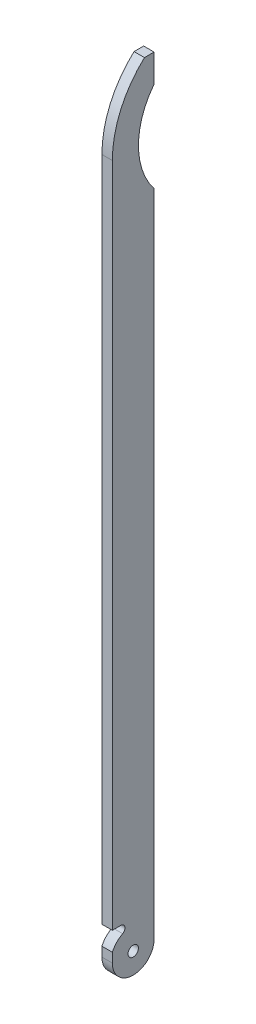
ISO-10303-21;
HEADER;
FILE_DESCRIPTION(('STEP AP214'),'2;1');
FILE_NAME('part.step','',(''),(''),'','','');
FILE_SCHEMA(('AUTOMOTIVE_DESIGN { 1 0 10303 214 1 1 1 1 }'));
ENDSEC;
DATA;
#1=APPLICATION_CONTEXT('core data for automotive mechanical design processes');
#2=APPLICATION_PROTOCOL_DEFINITION('international standard','automotive_design',2000,#1);
#3=PRODUCT_CONTEXT('',#1,'mechanical');
#4=PRODUCT('Part','Part','',(#3));
#5=PRODUCT_RELATED_PRODUCT_CATEGORY('part','',(#4));
#6=PRODUCT_DEFINITION_FORMATION('','',#4);
#7=PRODUCT_DEFINITION_CONTEXT('part definition',#1,'design');
#8=PRODUCT_DEFINITION('design','',#6,#7);
#9=PRODUCT_DEFINITION_SHAPE('','',#8);
#10=(LENGTH_UNIT() NAMED_UNIT(*) SI_UNIT(.MILLI.,.METRE.));
#11=(NAMED_UNIT(*) PLANE_ANGLE_UNIT() SI_UNIT($,.RADIAN.));
#12=(NAMED_UNIT(*) SI_UNIT($,.STERADIAN.) SOLID_ANGLE_UNIT());
#13=UNCERTAINTY_MEASURE_WITH_UNIT(LENGTH_MEASURE(1.E-05),#10,'distance_accuracy_value','');
#14=(GEOMETRIC_REPRESENTATION_CONTEXT(3) GLOBAL_UNCERTAINTY_ASSIGNED_CONTEXT((#13)) GLOBAL_UNIT_ASSIGNED_CONTEXT((#10,
#11,#12)) REPRESENTATION_CONTEXT('',''));
#15=CARTESIAN_POINT('',(0.,0.,0.));
#16=DIRECTION('',(0.,0.,1.));
#17=DIRECTION('',(1.,0.,0.));
#18=AXIS2_PLACEMENT_3D('',#15,#16,#17);
#19=CARTESIAN_POINT('',(0.,378.,20.));
#20=DIRECTION('',(0.,0.,-1.));
#21=DIRECTION('',(-1.,0.,0.));
#22=AXIS2_PLACEMENT_3D('',#19,#20,#21);
#23=PLANE('',#22);
#24=DIRECTION('',(0.,-1.,0.));
#25=VECTOR('',#24,1.);
#26=CARTESIAN_POINT('',(5.,378.,20.));
#27=LINE('',#26,#25);
#28=CARTESIAN_POINT('',(5.,14.520650354293,20.));
#29=VERTEX_POINT('',#28);
#30=CARTESIAN_POINT('',(5.00000000000001,10.,20.));
#31=VERTEX_POINT('',#30);
#32=EDGE_CURVE('E197',#29,#31,#27,.T.);
#33=ORIENTED_EDGE('',*,*,#32,.F.);
#34=DIRECTION('',(1.,0.,0.));
#35=VECTOR('',#34,1.);
#36=CARTESIAN_POINT('',(0.,14.520650354293,20.));
#37=LINE('',#36,#35);
#38=CARTESIAN_POINT('',(0.,14.520650354293,20.));
#39=VERTEX_POINT('',#38);
#40=EDGE_CURVE('E148',#39,#29,#37,.T.);
#41=ORIENTED_EDGE('',*,*,#40,.F.);
#42=DIRECTION('',(0.,-1.,0.));
#43=VECTOR('',#42,1.);
#44=CARTESIAN_POINT('',(0.,378.,20.));
#45=LINE('',#44,#43);
#46=CARTESIAN_POINT('',(0.,10.,20.));
#47=VERTEX_POINT('',#46);
#48=EDGE_CURVE('E201',#39,#47,#45,.T.);
#49=ORIENTED_EDGE('',*,*,#48,.T.);
#50=DIRECTION('',(-1.,0.,0.));
#51=VECTOR('',#50,1.);
#52=CARTESIAN_POINT('',(5.00000000000001,10.,20.));
#53=LINE('',#52,#51);
#54=EDGE_CURVE('E177',#31,#47,#53,.T.);
#55=ORIENTED_EDGE('',*,*,#54,.F.);
#56=EDGE_LOOP('',(#33,#41,#49,#55));
#57=FACE_BOUND('',#56,.T.);
#58=ADVANCED_FACE('F36',(#57),#23,.F.);
#59=CARTESIAN_POINT('',(0.,343.,20.));
#60=VERTEX_POINT('',#59);
#61=CARTESIAN_POINT('',(0.,23.61,20.));
#62=VERTEX_POINT('',#61);
#63=EDGE_CURVE('E202',#60,#62,#45,.T.);
#64=ORIENTED_EDGE('',*,*,#63,.T.);
#65=DIRECTION('',(1.,0.,0.));
#66=VECTOR('',#65,1.);
#67=CARTESIAN_POINT('',(0.,23.61,20.));
#68=LINE('',#67,#66);
#69=CARTESIAN_POINT('',(5.,23.61,20.));
#70=VERTEX_POINT('',#69);
#71=EDGE_CURVE('E124',#62,#70,#68,.T.);
#72=ORIENTED_EDGE('',*,*,#71,.T.);
#73=CARTESIAN_POINT('',(5.00000000000001,343.,20.));
#74=VERTEX_POINT('',#73);
#75=EDGE_CURVE('E198',#74,#70,#27,.T.);
#76=ORIENTED_EDGE('',*,*,#75,.F.);
#77=DIRECTION('',(-1.,0.,0.));
#78=VECTOR('',#77,1.);
#79=CARTESIAN_POINT('',(5.00000000000001,343.,20.));
#80=LINE('',#79,#78);
#81=EDGE_CURVE('E152',#74,#60,#80,.T.);
#82=ORIENTED_EDGE('',*,*,#81,.T.);
#83=EDGE_LOOP('',(#64,#72,#76,#82));
#84=FACE_BOUND('',#83,.T.);
#85=ADVANCED_FACE('F219',(#84),#23,.F.);
#86=CARTESIAN_POINT('',(0.,378.,0.));
#87=DIRECTION('',(0.,0.,1.));
#88=DIRECTION('',(1.,0.,0.));
#89=AXIS2_PLACEMENT_3D('',#86,#87,#88);
#90=PLANE('',#89);
#91=DIRECTION('',(0.,-1.,0.));
#92=VECTOR('',#91,1.);
#93=CARTESIAN_POINT('',(5.,378.,0.));
#94=LINE('',#93,#92);
#95=CARTESIAN_POINT('',(5.,378.,0.));
#96=VERTEX_POINT('',#95);
#97=CARTESIAN_POINT('',(5.,364.650635094611,0.));
#98=VERTEX_POINT('',#97);
#99=EDGE_CURVE('E194',#96,#98,#94,.T.);
#100=ORIENTED_EDGE('',*,*,#99,.T.);
#101=DIRECTION('',(-1.,0.,0.));
#102=VECTOR('',#101,1.);
#103=CARTESIAN_POINT('',(5.,364.650635094611,0.));
#104=LINE('',#103,#102);
#105=CARTESIAN_POINT('',(0.,364.650635094611,0.));
#106=VERTEX_POINT('',#105);
#107=EDGE_CURVE('E161',#98,#106,#104,.T.);
#108=ORIENTED_EDGE('',*,*,#107,.T.);
#109=DIRECTION('',(0.,-1.,0.));
#110=VECTOR('',#109,1.);
#111=CARTESIAN_POINT('',(0.,378.,0.));
#112=LINE('',#111,#110);
#113=CARTESIAN_POINT('',(0.,378.,0.));
#114=VERTEX_POINT('',#113);
#115=EDGE_CURVE('E190',#114,#106,#112,.T.);
#116=ORIENTED_EDGE('',*,*,#115,.F.);
#117=DIRECTION('',(-1.,0.,0.));
#118=VECTOR('',#117,1.);
#119=CARTESIAN_POINT('',(0.,378.,0.));
#120=LINE('',#119,#118);
#121=EDGE_CURVE('E187',#96,#114,#120,.T.);
#122=ORIENTED_EDGE('',*,*,#121,.F.);
#123=EDGE_LOOP('',(#100,#108,#116,#122));
#124=FACE_BOUND('',#123,.T.);
#125=ADVANCED_FACE('F212',(#124),#90,.F.);
#126=CARTESIAN_POINT('',(0.,321.349364905389,0.));
#127=VERTEX_POINT('',#126);
#128=CARTESIAN_POINT('',(0.,10.,0.));
#129=VERTEX_POINT('',#128);
#130=EDGE_CURVE('E189',#127,#129,#112,.T.);
#131=ORIENTED_EDGE('',*,*,#130,.F.);
#132=DIRECTION('',(-1.,0.,0.));
#133=VECTOR('',#132,1.);
#134=CARTESIAN_POINT('',(5.,321.349364905389,0.));
#135=LINE('',#134,#133);
#136=CARTESIAN_POINT('',(5.00000000000001,321.349364905389,0.));
#137=VERTEX_POINT('',#136);
#138=EDGE_CURVE('E158',#127,#137,#135,.F.);
#139=ORIENTED_EDGE('',*,*,#138,.T.);
#140=CARTESIAN_POINT('',(5.,10.,0.));
#141=VERTEX_POINT('',#140);
#142=EDGE_CURVE('E193',#137,#141,#94,.T.);
#143=ORIENTED_EDGE('',*,*,#142,.T.);
#144=DIRECTION('',(-1.,0.,0.));
#145=VECTOR('',#144,1.);
#146=CARTESIAN_POINT('',(5.,10.,0.));
#147=LINE('',#146,#145);
#148=EDGE_CURVE('E174',#141,#129,#147,.T.);
#149=ORIENTED_EDGE('',*,*,#148,.T.);
#150=EDGE_LOOP('',(#131,#139,#143,#149));
#151=FACE_BOUND('',#150,.T.);
#152=ADVANCED_FACE('F243',(#151),#90,.F.);
#153=CARTESIAN_POINT('',(0.,378.,0.));
#154=DIRECTION('',(1.,0.,0.));
#155=DIRECTION('',(0.,0.,-1.));
#156=AXIS2_PLACEMENT_3D('',#153,#154,#155);
#157=PLANE('',#156);
#158=CARTESIAN_POINT('',(0.,10.,10.));
#159=DIRECTION('',(-1.,0.,0.));
#160=DIRECTION('',(0.,0.,1.));
#161=AXIS2_PLACEMENT_3D('',#158,#159,#160);
#162=CIRCLE('',#161,2.5);
#163=CARTESIAN_POINT('',(0.,10.,12.5));
#164=VERTEX_POINT('',#163);
#165=EDGE_CURVE('E164',#164,#164,#162,.T.);
#166=ORIENTED_EDGE('',*,*,#165,.F.);
#167=EDGE_LOOP('',(#166));
#168=FACE_BOUND('',#167,.T.);
#169=ORIENTED_EDGE('',*,*,#48,.F.);
#170=CARTESIAN_POINT('',(0.,10.,10.));
#171=DIRECTION('',(-1.,0.,0.));
#172=DIRECTION('',(0.,0.,-1.));
#173=AXIS2_PLACEMENT_3D('',#170,#171,#172);
#174=CIRCLE('',#173,10.974346432739);
#175=CARTESIAN_POINT('',(0.,19.7404845162571,15.0556148008255));
#176=VERTEX_POINT('',#175);
#177=EDGE_CURVE('E125',#39,#176,#174,.T.);
#178=ORIENTED_EDGE('',*,*,#177,.T.);
#179=CARTESIAN_POINT('',(0.,21.56,16.));
#180=DIRECTION('',(1.,0.,0.));
#181=DIRECTION('',(0.,0.,-1.));
#182=AXIS2_PLACEMENT_3D('',#179,#180,#181);
#183=CIRCLE('',#182,2.05);
#184=CARTESIAN_POINT('',(0.,23.61,16.));
#185=VERTEX_POINT('',#184);
#186=EDGE_CURVE('E120',#176,#185,#183,.T.);
#187=ORIENTED_EDGE('',*,*,#186,.T.);
#188=DIRECTION('',(0.,0.,1.));
#189=VECTOR('',#188,1.);
#190=CARTESIAN_POINT('',(0.,23.61,16.));
#191=LINE('',#190,#189);
#192=EDGE_CURVE('E128',#185,#62,#191,.T.);
#193=ORIENTED_EDGE('',*,*,#192,.T.);
#194=ORIENTED_EDGE('',*,*,#63,.F.);
#195=CARTESIAN_POINT('',(0.,343.,-27.5));
#196=DIRECTION('',(1.,0.,0.));
#197=DIRECTION('',(0.,0.,1.));
#198=AXIS2_PLACEMENT_3D('',#195,#196,#197);
#199=CIRCLE('',#198,47.5);
#200=CARTESIAN_POINT('',(0.,378.,4.61308144666283));
#201=VERTEX_POINT('',#200);
#202=EDGE_CURVE('E147',#201,#60,#199,.T.);
#203=ORIENTED_EDGE('',*,*,#202,.F.);
#204=DIRECTION('',(0.,0.,1.));
#205=VECTOR('',#204,1.);
#206=CARTESIAN_POINT('',(0.,378.,0.));
#207=LINE('',#206,#205);
#208=EDGE_CURVE('E180',#114,#201,#207,.T.);
#209=ORIENTED_EDGE('',*,*,#208,.F.);
#210=ORIENTED_EDGE('',*,*,#115,.T.);
#211=CARTESIAN_POINT('',(0.,343.,-27.5));
#212=DIRECTION('',(-1.,0.,0.));
#213=DIRECTION('',(0.,0.,1.));
#214=AXIS2_PLACEMENT_3D('',#211,#212,#213);
#215=CIRCLE('',#214,35.);
#216=EDGE_CURVE('E156',#127,#106,#215,.T.);
#217=ORIENTED_EDGE('',*,*,#216,.F.);
#218=ORIENTED_EDGE('',*,*,#130,.T.);
#219=CARTESIAN_POINT('',(0.,10.,10.));
#220=DIRECTION('',(1.,0.,0.));
#221=DIRECTION('',(0.,0.,-1.));
#222=AXIS2_PLACEMENT_3D('',#219,#220,#221);
#223=CIRCLE('',#222,10.);
#224=EDGE_CURVE('E168',#47,#129,#223,.T.);
#225=ORIENTED_EDGE('',*,*,#224,.F.);
#226=EDGE_LOOP('',(#169,#178,#187,#193,#194,#203,#209,#210,#217,#218,#225));
#227=FACE_BOUND('',#226,.T.);
#228=ADVANCED_FACE('F38',(#168,#227),#157,.F.);
#229=CARTESIAN_POINT('',(5.,378.,0.));
#230=DIRECTION('',(-1.,0.,0.));
#231=DIRECTION('',(0.,0.,1.));
#232=AXIS2_PLACEMENT_3D('',#229,#230,#231);
#233=PLANE('',#232);
#234=CARTESIAN_POINT('',(5.00000000000001,10.,10.));
#235=DIRECTION('',(-1.,0.,0.));
#236=DIRECTION('',(0.,0.,1.));
#237=AXIS2_PLACEMENT_3D('',#234,#235,#236);
#238=CIRCLE('',#237,2.5);
#239=CARTESIAN_POINT('',(5.00000000000001,10.,12.5));
#240=VERTEX_POINT('',#239);
#241=EDGE_CURVE('E165',#240,#240,#238,.T.);
#242=ORIENTED_EDGE('',*,*,#241,.T.);
#243=EDGE_LOOP('',(#242));
#244=FACE_BOUND('',#243,.T.);
#245=CARTESIAN_POINT('',(5.,21.56,16.));
#246=DIRECTION('',(1.,0.,0.));
#247=DIRECTION('',(0.,0.,-1.));
#248=AXIS2_PLACEMENT_3D('',#245,#246,#247);
#249=CIRCLE('',#248,2.05);
#250=CARTESIAN_POINT('',(5.,19.7404845162571,15.0556148008255));
#251=VERTEX_POINT('',#250);
#252=CARTESIAN_POINT('',(5.,23.61,16.));
#253=VERTEX_POINT('',#252);
#254=EDGE_CURVE('E51',#251,#253,#249,.T.);
#255=ORIENTED_EDGE('',*,*,#254,.F.);
#256=CARTESIAN_POINT('',(5.,10.,10.));
#257=DIRECTION('',(-1.,0.,0.));
#258=DIRECTION('',(0.,0.,-1.));
#259=AXIS2_PLACEMENT_3D('',#256,#257,#258);
#260=CIRCLE('',#259,10.974346432739);
#261=EDGE_CURVE('E136',#29,#251,#260,.T.);
#262=ORIENTED_EDGE('',*,*,#261,.F.);
#263=ORIENTED_EDGE('',*,*,#32,.T.);
#264=CARTESIAN_POINT('',(5.,10.,10.));
#265=DIRECTION('',(1.,0.,0.));
#266=DIRECTION('',(0.,0.,-1.));
#267=AXIS2_PLACEMENT_3D('',#264,#265,#266);
#268=CIRCLE('',#267,10.);
#269=EDGE_CURVE('E171',#31,#141,#268,.T.);
#270=ORIENTED_EDGE('',*,*,#269,.T.);
#271=ORIENTED_EDGE('',*,*,#142,.F.);
#272=CARTESIAN_POINT('',(5.,343.,-27.5));
#273=DIRECTION('',(-1.,0.,0.));
#274=DIRECTION('',(0.,0.,1.));
#275=AXIS2_PLACEMENT_3D('',#272,#273,#274);
#276=CIRCLE('',#275,35.);
#277=EDGE_CURVE('E44',#137,#98,#276,.T.);
#278=ORIENTED_EDGE('',*,*,#277,.T.);
#279=ORIENTED_EDGE('',*,*,#99,.F.);
#280=DIRECTION('',(0.,0.,-1.));
#281=VECTOR('',#280,1.);
#282=CARTESIAN_POINT('',(5.,378.,0.));
#283=LINE('',#282,#281);
#284=CARTESIAN_POINT('',(5.,378.,4.61308144666283));
#285=VERTEX_POINT('',#284);
#286=EDGE_CURVE('E185',#285,#96,#283,.T.);
#287=ORIENTED_EDGE('',*,*,#286,.F.);
#288=CARTESIAN_POINT('',(5.,343.,-27.5));
#289=DIRECTION('',(1.,0.,0.));
#290=DIRECTION('',(0.,0.,1.));
#291=AXIS2_PLACEMENT_3D('',#288,#289,#290);
#292=CIRCLE('',#291,47.5);
#293=EDGE_CURVE('E58',#285,#74,#292,.T.);
#294=ORIENTED_EDGE('',*,*,#293,.T.);
#295=ORIENTED_EDGE('',*,*,#75,.T.);
#296=DIRECTION('',(0.,0.,1.));
#297=VECTOR('',#296,1.);
#298=CARTESIAN_POINT('',(5.,23.61,16.));
#299=LINE('',#298,#297);
#300=EDGE_CURVE('E139',#253,#70,#299,.T.);
#301=ORIENTED_EDGE('',*,*,#300,.F.);
#302=EDGE_LOOP('',(#255,#262,#263,#270,#271,#278,#279,#287,#294,#295,#301));
#303=FACE_BOUND('',#302,.T.);
#304=ADVANCED_FACE('F207',(#244,#303),#233,.F.);
#305=CARTESIAN_POINT('',(0.,378.,0.));
#306=DIRECTION('',(0.,1.,0.));
#307=DIRECTION('',(0.,0.,1.));
#308=AXIS2_PLACEMENT_3D('',#305,#306,#307);
#309=PLANE('',#308);
#310=DIRECTION('',(-1.,0.,0.));
#311=VECTOR('',#310,1.);
#312=CARTESIAN_POINT('',(5.00000000000001,378.,4.61308144666283));
#313=LINE('',#312,#311);
#314=EDGE_CURVE('E11',#285,#201,#313,.T.);
#315=ORIENTED_EDGE('',*,*,#314,.F.);
#316=ORIENTED_EDGE('',*,*,#286,.T.);
#317=ORIENTED_EDGE('',*,*,#121,.T.);
#318=ORIENTED_EDGE('',*,*,#208,.T.);
#319=EDGE_LOOP('',(#315,#316,#317,#318));
#320=FACE_BOUND('',#319,.T.);
#321=ADVANCED_FACE('F216',(#320),#309,.T.);
#322=CARTESIAN_POINT('',(5.,10.,10.));
#323=DIRECTION('',(-1.,0.,0.));
#324=DIRECTION('',(0.,0.,1.));
#325=AXIS2_PLACEMENT_3D('',#322,#323,#324);
#326=CYLINDRICAL_SURFACE('',#325,10.);
#327=ORIENTED_EDGE('',*,*,#224,.T.);
#328=ORIENTED_EDGE('',*,*,#148,.F.);
#329=ORIENTED_EDGE('',*,*,#269,.F.);
#330=ORIENTED_EDGE('',*,*,#54,.T.);
#331=EDGE_LOOP('',(#327,#328,#329,#330));
#332=FACE_BOUND('',#331,.T.);
#333=ADVANCED_FACE('F249',(#332),#326,.T.);
#334=CARTESIAN_POINT('',(5.00000000000001,10.,10.));
#335=DIRECTION('',(-1.,0.,0.));
#336=DIRECTION('',(0.,0.,1.));
#337=AXIS2_PLACEMENT_3D('',#334,#335,#336);
#338=CYLINDRICAL_SURFACE('',#337,2.5);
#339=ORIENTED_EDGE('',*,*,#241,.F.);
#340=EDGE_LOOP('',(#339));
#341=FACE_BOUND('',#340,.T.);
#342=ORIENTED_EDGE('',*,*,#165,.T.);
#343=EDGE_LOOP('',(#342));
#344=FACE_BOUND('',#343,.T.);
#345=ADVANCED_FACE('F231',(#341,#344),#338,.F.);
#346=CARTESIAN_POINT('',(5.,343.,-27.5));
#347=DIRECTION('',(-1.,0.,0.));
#348=DIRECTION('',(0.,0.,1.));
#349=AXIS2_PLACEMENT_3D('',#346,#347,#348);
#350=CYLINDRICAL_SURFACE('',#349,35.);
#351=ORIENTED_EDGE('',*,*,#277,.F.);
#352=ORIENTED_EDGE('',*,*,#138,.F.);
#353=ORIENTED_EDGE('',*,*,#216,.T.);
#354=ORIENTED_EDGE('',*,*,#107,.F.);
#355=EDGE_LOOP('',(#351,#352,#353,#354));
#356=FACE_BOUND('',#355,.T.);
#357=ADVANCED_FACE('F223',(#356),#350,.F.);
#358=CARTESIAN_POINT('',(5.,343.,-27.5));
#359=DIRECTION('',(-1.,0.,0.));
#360=DIRECTION('',(0.,0.,1.));
#361=AXIS2_PLACEMENT_3D('',#358,#359,#360);
#362=CYLINDRICAL_SURFACE('',#361,47.5);
#363=ORIENTED_EDGE('',*,*,#314,.T.);
#364=ORIENTED_EDGE('',*,*,#202,.T.);
#365=ORIENTED_EDGE('',*,*,#81,.F.);
#366=ORIENTED_EDGE('',*,*,#293,.F.);
#367=EDGE_LOOP('',(#363,#364,#365,#366));
#368=FACE_BOUND('',#367,.T.);
#369=ADVANCED_FACE('F221',(#368),#362,.T.);
#370=CARTESIAN_POINT('',(0.,21.56,16.));
#371=DIRECTION('',(1.,0.,0.));
#372=DIRECTION('',(0.,0.,-1.));
#373=AXIS2_PLACEMENT_3D('',#370,#371,#372);
#374=CYLINDRICAL_SURFACE('',#373,2.05);
#375=ORIENTED_EDGE('',*,*,#254,.T.);
#376=DIRECTION('',(1.,0.,0.));
#377=VECTOR('',#376,1.);
#378=CARTESIAN_POINT('',(0.,23.61,16.));
#379=LINE('',#378,#377);
#380=EDGE_CURVE('E116',#185,#253,#379,.T.);
#381=ORIENTED_EDGE('',*,*,#380,.F.);
#382=ORIENTED_EDGE('',*,*,#186,.F.);
#383=DIRECTION('',(1.,0.,0.));
#384=VECTOR('',#383,1.);
#385=CARTESIAN_POINT('',(0.,19.7404845162571,15.0556148008255));
#386=LINE('',#385,#384);
#387=EDGE_CURVE('E145',#176,#251,#386,.T.);
#388=ORIENTED_EDGE('',*,*,#387,.T.);
#389=EDGE_LOOP('',(#375,#381,#382,#388));
#390=FACE_BOUND('',#389,.T.);
#391=ADVANCED_FACE('F118',(#390),#374,.F.);
#392=CARTESIAN_POINT('',(0.,10.,10.));
#393=DIRECTION('',(1.,0.,0.));
#394=DIRECTION('',(0.,0.,-1.));
#395=AXIS2_PLACEMENT_3D('',#392,#393,#394);
#396=CYLINDRICAL_SURFACE('',#395,10.974346432739);
#397=ORIENTED_EDGE('',*,*,#261,.T.);
#398=ORIENTED_EDGE('',*,*,#387,.F.);
#399=ORIENTED_EDGE('',*,*,#177,.F.);
#400=ORIENTED_EDGE('',*,*,#40,.T.);
#401=EDGE_LOOP('',(#397,#398,#399,#400));
#402=FACE_BOUND('',#401,.T.);
#403=ADVANCED_FACE('F229',(#402),#396,.T.);
#404=CARTESIAN_POINT('',(0.,23.61,16.));
#405=DIRECTION('',(0.,1.,0.));
#406=DIRECTION('',(0.,0.,1.));
#407=AXIS2_PLACEMENT_3D('',#404,#405,#406);
#408=PLANE('',#407);
#409=ORIENTED_EDGE('',*,*,#300,.T.);
#410=ORIENTED_EDGE('',*,*,#71,.F.);
#411=ORIENTED_EDGE('',*,*,#192,.F.);
#412=ORIENTED_EDGE('',*,*,#380,.T.);
#413=EDGE_LOOP('',(#409,#410,#411,#412));
#414=FACE_BOUND('',#413,.T.);
#415=ADVANCED_FACE('F129',(#414),#408,.F.);
#416=CLOSED_SHELL('',(#58,#85,#125,#152,#228,#304,#321,#333,#345,#357,#369,#391,#403,#415));
#417=MANIFOLD_SOLID_BREP('B2',#416);
#418=ADVANCED_BREP_SHAPE_REPRESENTATION('',(#18,#417),#14);
#419=SHAPE_DEFINITION_REPRESENTATION(#9,#418);
ENDSEC;
END-ISO-10303-21;
